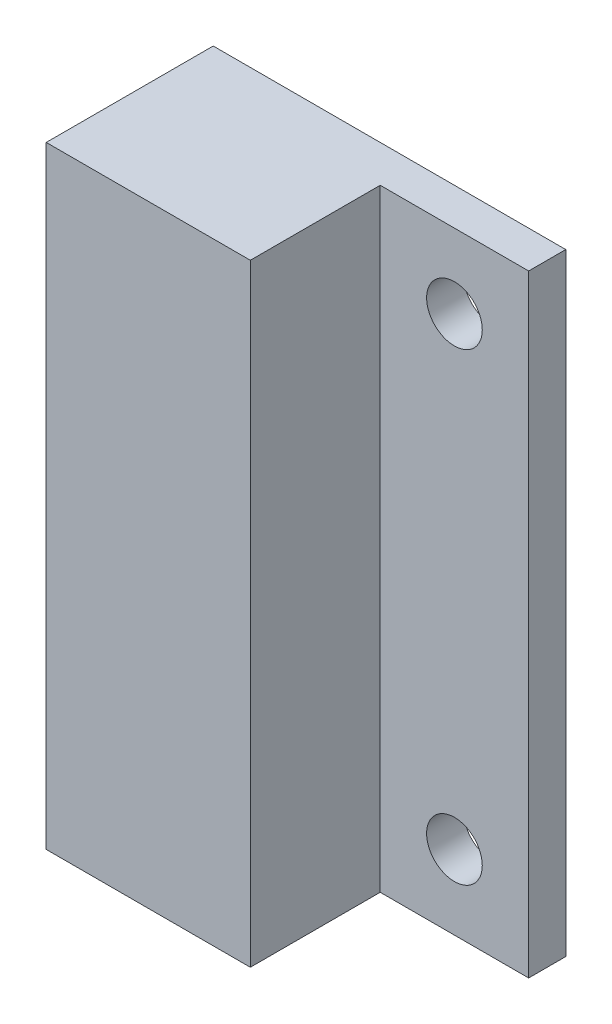
ISO-10303-21;
HEADER;
FILE_DESCRIPTION(('STEP AP214'),'2;1');
FILE_NAME('part.step','',(''),(''),'','','');
FILE_SCHEMA(('AUTOMOTIVE_DESIGN { 1 0 10303 214 1 1 1 1 }'));
ENDSEC;
DATA;
#1=APPLICATION_CONTEXT('core data for automotive mechanical design processes');
#2=APPLICATION_PROTOCOL_DEFINITION('international standard','automotive_design',2000,#1);
#3=PRODUCT_CONTEXT('',#1,'mechanical');
#4=PRODUCT('Part','Part','',(#3));
#5=PRODUCT_RELATED_PRODUCT_CATEGORY('part','',(#4));
#6=PRODUCT_DEFINITION_FORMATION('','',#4);
#7=PRODUCT_DEFINITION_CONTEXT('part definition',#1,'design');
#8=PRODUCT_DEFINITION('design','',#6,#7);
#9=PRODUCT_DEFINITION_SHAPE('','',#8);
#10=(LENGTH_UNIT() NAMED_UNIT(*) SI_UNIT(.MILLI.,.METRE.));
#11=(NAMED_UNIT(*) PLANE_ANGLE_UNIT() SI_UNIT($,.RADIAN.));
#12=(NAMED_UNIT(*) SI_UNIT($,.STERADIAN.) SOLID_ANGLE_UNIT());
#13=UNCERTAINTY_MEASURE_WITH_UNIT(LENGTH_MEASURE(1.E-05),#10,'distance_accuracy_value','');
#14=(GEOMETRIC_REPRESENTATION_CONTEXT(3) GLOBAL_UNCERTAINTY_ASSIGNED_CONTEXT((#13)) GLOBAL_UNIT_ASSIGNED_CONTEXT((#10,
#11,#12)) REPRESENTATION_CONTEXT('',''));
#15=CARTESIAN_POINT('',(0.,0.,0.));
#16=DIRECTION('',(0.,0.,1.));
#17=DIRECTION('',(1.,0.,0.));
#18=AXIS2_PLACEMENT_3D('',#15,#16,#17);
#19=CARTESIAN_POINT('',(0.,0.,2.));
#20=DIRECTION('',(0.,0.,-1.));
#21=DIRECTION('',(-1.,0.,0.));
#22=AXIS2_PLACEMENT_3D('',#19,#20,#21);
#23=PLANE('',#22);
#24=DIRECTION('',(0.,1.,0.));
#25=VECTOR('',#24,1.);
#26=CARTESIAN_POINT('',(19.,33.,2.));
#27=LINE('',#26,#25);
#28=CARTESIAN_POINT('',(19.,0.,2.));
#29=VERTEX_POINT('',#28);
#30=CARTESIAN_POINT('',(19.,33.,2.));
#31=VERTEX_POINT('',#30);
#32=EDGE_CURVE('E115',#29,#31,#27,.T.);
#33=ORIENTED_EDGE('',*,*,#32,.T.);
#34=DIRECTION('',(-1.,0.,0.));
#35=VECTOR('',#34,1.);
#36=CARTESIAN_POINT('',(19.,33.,2.));
#37=LINE('',#36,#35);
#38=CARTESIAN_POINT('',(11.,33.,2.));
#39=VERTEX_POINT('',#38);
#40=EDGE_CURVE('E136',#31,#39,#37,.T.);
#41=ORIENTED_EDGE('',*,*,#40,.T.);
#42=DIRECTION('',(0.,-1.,0.));
#43=VECTOR('',#42,1.);
#44=CARTESIAN_POINT('',(11.,33.,2.));
#45=LINE('',#44,#43);
#46=CARTESIAN_POINT('',(11.,0.,2.));
#47=VERTEX_POINT('',#46);
#48=EDGE_CURVE('E133',#39,#47,#45,.T.);
#49=ORIENTED_EDGE('',*,*,#48,.T.);
#50=DIRECTION('',(1.,0.,0.));
#51=VECTOR('',#50,1.);
#52=CARTESIAN_POINT('',(19.,0.,2.));
#53=LINE('',#52,#51);
#54=EDGE_CURVE('E126',#47,#29,#53,.T.);
#55=ORIENTED_EDGE('',*,*,#54,.T.);
#56=EDGE_LOOP('',(#33,#41,#49,#55));
#57=FACE_BOUND('',#56,.T.);
#58=CARTESIAN_POINT('',(15.,29.,2.));
#59=DIRECTION('',(0.,0.,1.));
#60=DIRECTION('',(1.,0.,0.));
#61=AXIS2_PLACEMENT_3D('',#58,#59,#60);
#62=CIRCLE('',#61,1.5);
#63=CARTESIAN_POINT('',(16.5,29.,2.));
#64=VERTEX_POINT('',#63);
#65=EDGE_CURVE('E142',#64,#64,#62,.T.);
#66=ORIENTED_EDGE('',*,*,#65,.F.);
#67=EDGE_LOOP('',(#66));
#68=FACE_BOUND('',#67,.T.);
#69=CARTESIAN_POINT('',(15.,4.,2.));
#70=DIRECTION('',(0.,0.,1.));
#71=DIRECTION('',(1.,0.,0.));
#72=AXIS2_PLACEMENT_3D('',#69,#70,#71);
#73=CIRCLE('',#72,1.5);
#74=CARTESIAN_POINT('',(16.5,4.,2.));
#75=VERTEX_POINT('',#74);
#76=EDGE_CURVE('E148',#75,#75,#73,.T.);
#77=ORIENTED_EDGE('',*,*,#76,.F.);
#78=EDGE_LOOP('',(#77));
#79=FACE_BOUND('',#78,.T.);
#80=ADVANCED_FACE('F36',(#57,#68,#79),#23,.F.);
#81=CARTESIAN_POINT('',(0.,0.,9.));
#82=DIRECTION('',(1.,0.,0.));
#83=DIRECTION('',(0.,0.,-1.));
#84=AXIS2_PLACEMENT_3D('',#81,#82,#83);
#85=PLANE('',#84);
#86=DIRECTION('',(0.,-1.,0.));
#87=VECTOR('',#86,1.);
#88=CARTESIAN_POINT('',(0.,0.,0.));
#89=LINE('',#88,#87);
#90=CARTESIAN_POINT('',(0.,33.,0.));
#91=VERTEX_POINT('',#90);
#92=CARTESIAN_POINT('',(0.,0.,0.));
#93=VERTEX_POINT('',#92);
#94=EDGE_CURVE('E96',#91,#93,#89,.T.);
#95=ORIENTED_EDGE('',*,*,#94,.T.);
#96=DIRECTION('',(0.,0.,-1.));
#97=VECTOR('',#96,1.);
#98=CARTESIAN_POINT('',(0.,0.,9.));
#99=LINE('',#98,#97);
#100=CARTESIAN_POINT('',(0.,0.,9.));
#101=VERTEX_POINT('',#100);
#102=EDGE_CURVE('E11',#101,#93,#99,.T.);
#103=ORIENTED_EDGE('',*,*,#102,.F.);
#104=DIRECTION('',(0.,-1.,0.));
#105=VECTOR('',#104,1.);
#106=CARTESIAN_POINT('',(0.,0.,9.));
#107=LINE('',#106,#105);
#108=CARTESIAN_POINT('',(0.,33.,9.));
#109=VERTEX_POINT('',#108);
#110=EDGE_CURVE('E90',#109,#101,#107,.T.);
#111=ORIENTED_EDGE('',*,*,#110,.F.);
#112=DIRECTION('',(0.,0.,-1.));
#113=VECTOR('',#112,1.);
#114=CARTESIAN_POINT('',(0.,33.,9.));
#115=LINE('',#114,#113);
#116=EDGE_CURVE('E81',#109,#91,#115,.T.);
#117=ORIENTED_EDGE('',*,*,#116,.T.);
#118=EDGE_LOOP('',(#95,#103,#111,#117));
#119=FACE_BOUND('',#118,.T.);
#120=ADVANCED_FACE('F38',(#119),#85,.F.);
#121=CARTESIAN_POINT('',(0.,0.,9.));
#122=DIRECTION('',(0.,1.,0.));
#123=DIRECTION('',(0.,0.,1.));
#124=AXIS2_PLACEMENT_3D('',#121,#122,#123);
#125=PLANE('',#124);
#126=ORIENTED_EDGE('',*,*,#54,.F.);
#127=DIRECTION('',(0.,0.,1.));
#128=VECTOR('',#127,1.);
#129=CARTESIAN_POINT('',(11.,0.,2.));
#130=LINE('',#129,#128);
#131=CARTESIAN_POINT('',(11.,0.,9.));
#132=VERTEX_POINT('',#131);
#133=EDGE_CURVE('E101',#47,#132,#130,.T.);
#134=ORIENTED_EDGE('',*,*,#133,.T.);
#135=DIRECTION('',(1.,0.,0.));
#136=VECTOR('',#135,1.);
#137=CARTESIAN_POINT('',(0.,0.,9.));
#138=LINE('',#137,#136);
#139=EDGE_CURVE('E120',#101,#132,#138,.T.);
#140=ORIENTED_EDGE('',*,*,#139,.F.);
#141=ORIENTED_EDGE('',*,*,#102,.T.);
#142=DIRECTION('',(1.,0.,0.));
#143=VECTOR('',#142,1.);
#144=CARTESIAN_POINT('',(0.,0.,0.));
#145=LINE('',#144,#143);
#146=CARTESIAN_POINT('',(19.,0.,0.));
#147=VERTEX_POINT('',#146);
#148=EDGE_CURVE('E100',#93,#147,#145,.T.);
#149=ORIENTED_EDGE('',*,*,#148,.T.);
#150=DIRECTION('',(0.,0.,-1.));
#151=VECTOR('',#150,1.);
#152=CARTESIAN_POINT('',(19.,0.,9.));
#153=LINE('',#152,#151);
#154=EDGE_CURVE('E44',#29,#147,#153,.T.);
#155=ORIENTED_EDGE('',*,*,#154,.F.);
#156=EDGE_LOOP('',(#126,#134,#140,#141,#149,#155));
#157=FACE_BOUND('',#156,.T.);
#158=ADVANCED_FACE('F118',(#157),#125,.F.);
#159=CARTESIAN_POINT('',(19.,0.,9.));
#160=DIRECTION('',(-1.,0.,0.));
#161=DIRECTION('',(0.,-1.,0.));
#162=AXIS2_PLACEMENT_3D('',#159,#160,#161);
#163=PLANE('',#162);
#164=DIRECTION('',(0.,0.,-1.));
#165=VECTOR('',#164,1.);
#166=CARTESIAN_POINT('',(19.,33.,9.));
#167=LINE('',#166,#165);
#168=CARTESIAN_POINT('',(19.,33.,0.));
#169=VERTEX_POINT('',#168);
#170=EDGE_CURVE('E85',#31,#169,#167,.T.);
#171=ORIENTED_EDGE('',*,*,#170,.F.);
#172=ORIENTED_EDGE('',*,*,#32,.F.);
#173=ORIENTED_EDGE('',*,*,#154,.T.);
#174=DIRECTION('',(0.,1.,0.));
#175=VECTOR('',#174,1.);
#176=CARTESIAN_POINT('',(19.,0.,0.));
#177=LINE('',#176,#175);
#178=EDGE_CURVE('E91',#147,#169,#177,.T.);
#179=ORIENTED_EDGE('',*,*,#178,.T.);
#180=EDGE_LOOP('',(#171,#172,#173,#179));
#181=FACE_BOUND('',#180,.T.);
#182=ADVANCED_FACE('F113',(#181),#163,.F.);
#183=CARTESIAN_POINT('',(0.,33.,9.));
#184=DIRECTION('',(0.,-1.,0.));
#185=DIRECTION('',(0.,0.,-1.));
#186=AXIS2_PLACEMENT_3D('',#183,#184,#185);
#187=PLANE('',#186);
#188=DIRECTION('',(-1.,0.,0.));
#189=VECTOR('',#188,1.);
#190=CARTESIAN_POINT('',(0.,33.,9.));
#191=LINE('',#190,#189);
#192=CARTESIAN_POINT('',(11.,33.,9.));
#193=VERTEX_POINT('',#192);
#194=EDGE_CURVE('E59',#193,#109,#191,.T.);
#195=ORIENTED_EDGE('',*,*,#194,.F.);
#196=DIRECTION('',(0.,0.,1.));
#197=VECTOR('',#196,1.);
#198=CARTESIAN_POINT('',(11.,33.,2.));
#199=LINE('',#198,#197);
#200=EDGE_CURVE('E51',#39,#193,#199,.T.);
#201=ORIENTED_EDGE('',*,*,#200,.F.);
#202=ORIENTED_EDGE('',*,*,#40,.F.);
#203=ORIENTED_EDGE('',*,*,#170,.T.);
#204=DIRECTION('',(-1.,0.,0.));
#205=VECTOR('',#204,1.);
#206=CARTESIAN_POINT('',(0.,33.,0.));
#207=LINE('',#206,#205);
#208=EDGE_CURVE('E78',#169,#91,#207,.T.);
#209=ORIENTED_EDGE('',*,*,#208,.T.);
#210=ORIENTED_EDGE('',*,*,#116,.F.);
#211=EDGE_LOOP('',(#195,#201,#202,#203,#209,#210));
#212=FACE_BOUND('',#211,.T.);
#213=ADVANCED_FACE('F80',(#212),#187,.F.);
#214=CARTESIAN_POINT('',(0.,0.,9.));
#215=DIRECTION('',(0.,0.,-1.));
#216=DIRECTION('',(-1.,0.,0.));
#217=AXIS2_PLACEMENT_3D('',#214,#215,#216);
#218=PLANE('',#217);
#219=ORIENTED_EDGE('',*,*,#139,.T.);
#220=DIRECTION('',(0.,-1.,0.));
#221=VECTOR('',#220,1.);
#222=CARTESIAN_POINT('',(11.,33.,9.));
#223=LINE('',#222,#221);
#224=EDGE_CURVE('E128',#193,#132,#223,.T.);
#225=ORIENTED_EDGE('',*,*,#224,.F.);
#226=ORIENTED_EDGE('',*,*,#194,.T.);
#227=ORIENTED_EDGE('',*,*,#110,.T.);
#228=EDGE_LOOP('',(#219,#225,#226,#227));
#229=FACE_BOUND('',#228,.T.);
#230=ADVANCED_FACE('F123',(#229),#218,.F.);
#231=CARTESIAN_POINT('',(0.,0.,0.));
#232=DIRECTION('',(0.,0.,-1.));
#233=DIRECTION('',(-1.,0.,0.));
#234=AXIS2_PLACEMENT_3D('',#231,#232,#233);
#235=PLANE('',#234);
#236=CARTESIAN_POINT('',(15.,4.,0.));
#237=DIRECTION('',(0.,0.,-1.));
#238=DIRECTION('',(-1.,0.,0.));
#239=AXIS2_PLACEMENT_3D('',#236,#237,#238);
#240=CIRCLE('',#239,1.5);
#241=CARTESIAN_POINT('',(13.5,4.,0.));
#242=VERTEX_POINT('',#241);
#243=EDGE_CURVE('E145',#242,#242,#240,.T.);
#244=ORIENTED_EDGE('',*,*,#243,.F.);
#245=EDGE_LOOP('',(#244));
#246=FACE_BOUND('',#245,.T.);
#247=CARTESIAN_POINT('',(15.,29.,0.));
#248=DIRECTION('',(0.,0.,-1.));
#249=DIRECTION('',(-1.,0.,0.));
#250=AXIS2_PLACEMENT_3D('',#247,#248,#249);
#251=CIRCLE('',#250,1.5);
#252=CARTESIAN_POINT('',(13.5,29.,0.));
#253=VERTEX_POINT('',#252);
#254=EDGE_CURVE('E130',#253,#253,#251,.T.);
#255=ORIENTED_EDGE('',*,*,#254,.F.);
#256=EDGE_LOOP('',(#255));
#257=FACE_BOUND('',#256,.T.);
#258=ORIENTED_EDGE('',*,*,#94,.F.);
#259=ORIENTED_EDGE('',*,*,#208,.F.);
#260=ORIENTED_EDGE('',*,*,#178,.F.);
#261=ORIENTED_EDGE('',*,*,#148,.F.);
#262=EDGE_LOOP('',(#258,#259,#260,#261));
#263=FACE_BOUND('',#262,.T.);
#264=ADVANCED_FACE('F98',(#246,#257,#263),#235,.T.);
#265=CARTESIAN_POINT('',(11.,33.,2.));
#266=DIRECTION('',(-1.,0.,0.));
#267=DIRECTION('',(0.,-1.,0.));
#268=AXIS2_PLACEMENT_3D('',#265,#266,#267);
#269=PLANE('',#268);
#270=ORIENTED_EDGE('',*,*,#224,.T.);
#271=ORIENTED_EDGE('',*,*,#133,.F.);
#272=ORIENTED_EDGE('',*,*,#48,.F.);
#273=ORIENTED_EDGE('',*,*,#200,.T.);
#274=EDGE_LOOP('',(#270,#271,#272,#273));
#275=FACE_BOUND('',#274,.T.);
#276=ADVANCED_FACE('F166',(#275),#269,.F.);
#277=CARTESIAN_POINT('',(15.,29.,2.));
#278=DIRECTION('',(0.,0.,1.));
#279=DIRECTION('',(1.,0.,0.));
#280=AXIS2_PLACEMENT_3D('',#277,#278,#279);
#281=CYLINDRICAL_SURFACE('',#280,1.5);
#282=ORIENTED_EDGE('',*,*,#65,.T.);
#283=EDGE_LOOP('',(#282));
#284=FACE_BOUND('',#283,.T.);
#285=ORIENTED_EDGE('',*,*,#254,.T.);
#286=EDGE_LOOP('',(#285));
#287=FACE_BOUND('',#286,.T.);
#288=ADVANCED_FACE('F164',(#284,#287),#281,.F.);
#289=CARTESIAN_POINT('',(15.,4.,2.));
#290=DIRECTION('',(0.,0.,1.));
#291=DIRECTION('',(1.,0.,0.));
#292=AXIS2_PLACEMENT_3D('',#289,#290,#291);
#293=CYLINDRICAL_SURFACE('',#292,1.5);
#294=ORIENTED_EDGE('',*,*,#76,.T.);
#295=EDGE_LOOP('',(#294));
#296=FACE_BOUND('',#295,.T.);
#297=ORIENTED_EDGE('',*,*,#243,.T.);
#298=EDGE_LOOP('',(#297));
#299=FACE_BOUND('',#298,.T.);
#300=ADVANCED_FACE('F152',(#296,#299),#293,.F.);
#301=CLOSED_SHELL('',(#80,#120,#158,#182,#213,#230,#264,#276,#288,#300));
#302=MANIFOLD_SOLID_BREP('B2',#301);
#303=ADVANCED_BREP_SHAPE_REPRESENTATION('',(#18,#302),#14);
#304=SHAPE_DEFINITION_REPRESENTATION(#9,#303);
ENDSEC;
END-ISO-10303-21;
